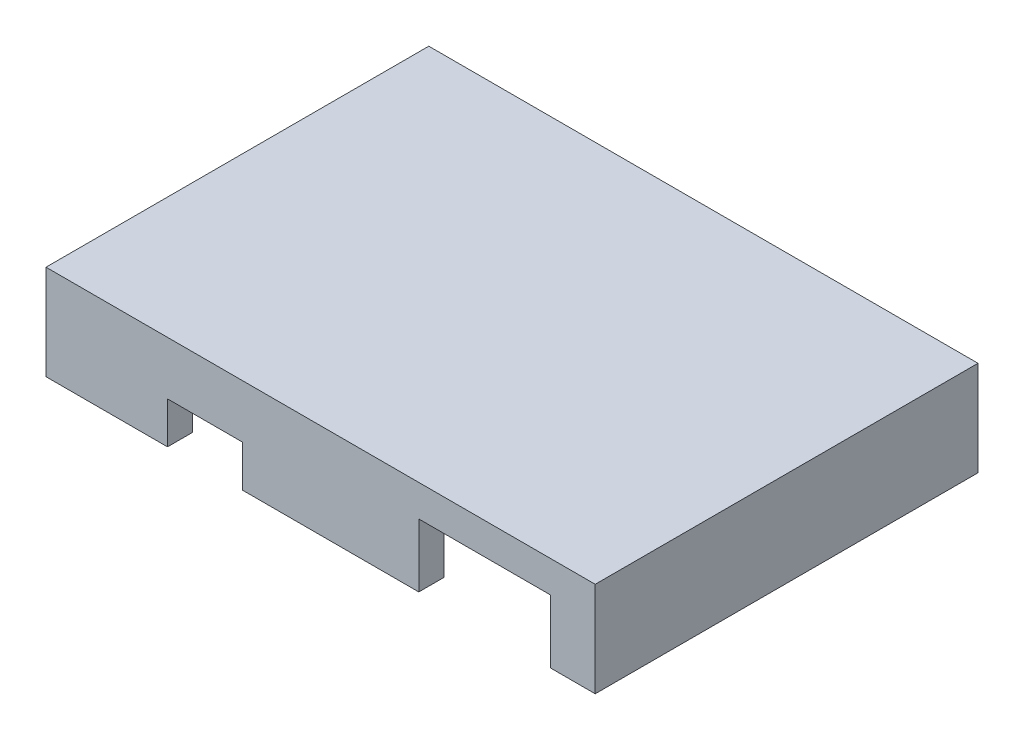
ISO-10303-21;
HEADER;
FILE_DESCRIPTION(('STEP AP214'),'2;1');
FILE_NAME('part.step','',(''),(''),'','','');
FILE_SCHEMA(('AUTOMOTIVE_DESIGN { 1 0 10303 214 1 1 1 1 }'));
ENDSEC;
DATA;
#1=APPLICATION_CONTEXT('core data for automotive mechanical design processes');
#2=APPLICATION_PROTOCOL_DEFINITION('international standard','automotive_design',2000,#1);
#3=PRODUCT_CONTEXT('',#1,'mechanical');
#4=PRODUCT('Part','Part','',(#3));
#5=PRODUCT_RELATED_PRODUCT_CATEGORY('part','',(#4));
#6=PRODUCT_DEFINITION_FORMATION('','',#4);
#7=PRODUCT_DEFINITION_CONTEXT('part definition',#1,'design');
#8=PRODUCT_DEFINITION('design','',#6,#7);
#9=PRODUCT_DEFINITION_SHAPE('','',#8);
#10=(LENGTH_UNIT() NAMED_UNIT(*) SI_UNIT(.MILLI.,.METRE.));
#11=(NAMED_UNIT(*) PLANE_ANGLE_UNIT() SI_UNIT($,.RADIAN.));
#12=(NAMED_UNIT(*) SI_UNIT($,.STERADIAN.) SOLID_ANGLE_UNIT());
#13=UNCERTAINTY_MEASURE_WITH_UNIT(LENGTH_MEASURE(1.E-05),#10,'distance_accuracy_value','');
#14=(GEOMETRIC_REPRESENTATION_CONTEXT(3) GLOBAL_UNCERTAINTY_ASSIGNED_CONTEXT((#13)) GLOBAL_UNIT_ASSIGNED_CONTEXT((#10,
#11,#12)) REPRESENTATION_CONTEXT('',''));
#15=CARTESIAN_POINT('',(0.,0.,0.));
#16=DIRECTION('',(0.,0.,1.));
#17=DIRECTION('',(1.,0.,0.));
#18=AXIS2_PLACEMENT_3D('',#15,#16,#17);
#19=CARTESIAN_POINT('',(0.,4.2,0.));
#20=DIRECTION('',(0.,1.,0.));
#21=DIRECTION('',(0.,0.,1.));
#22=AXIS2_PLACEMENT_3D('',#19,#20,#21);
#23=PLANE('',#22);
#24=DIRECTION('',(1.,0.,0.));
#25=VECTOR('',#24,1.);
#26=CARTESIAN_POINT('',(-15.,4.2,8.8));
#27=LINE('',#26,#25);
#28=CARTESIAN_POINT('',(-15.,4.2,8.8));
#29=VERTEX_POINT('',#28);
#30=CARTESIAN_POINT('',(-13.8,4.2,8.8));
#31=VERTEX_POINT('',#30);
#32=EDGE_CURVE('E293',#29,#31,#27,.T.);
#33=ORIENTED_EDGE('',*,*,#32,.F.);
#34=DIRECTION('',(0.,0.,1.));
#35=VECTOR('',#34,1.);
#36=CARTESIAN_POINT('',(-15.,4.2,-10.));
#37=LINE('',#36,#35);
#38=CARTESIAN_POINT('',(-15.,4.2,-3.3));
#39=VERTEX_POINT('',#38);
#40=EDGE_CURVE('E471',#39,#29,#37,.T.);
#41=ORIENTED_EDGE('',*,*,#40,.F.);
#42=DIRECTION('',(-1.,0.,0.));
#43=VECTOR('',#42,1.);
#44=CARTESIAN_POINT('',(-15.,4.2,-3.30000000000001));
#45=LINE('',#44,#43);
#46=CARTESIAN_POINT('',(-13.8,4.2,-3.30000000000001));
#47=VERTEX_POINT('',#46);
#48=EDGE_CURVE('E298',#47,#39,#45,.T.);
#49=ORIENTED_EDGE('',*,*,#48,.F.);
#50=DIRECTION('',(0.,0.,1.));
#51=VECTOR('',#50,1.);
#52=CARTESIAN_POINT('',(-13.8,4.2,-6.6));
#53=LINE('',#52,#51);
#54=CARTESIAN_POINT('',(-13.8,4.2,-6.6));
#55=VERTEX_POINT('',#54);
#56=EDGE_CURVE('E303',#55,#47,#53,.T.);
#57=ORIENTED_EDGE('',*,*,#56,.F.);
#58=DIRECTION('',(1.,0.,0.));
#59=VECTOR('',#58,1.);
#60=CARTESIAN_POINT('',(-15.,4.2,-6.6));
#61=LINE('',#60,#59);
#62=CARTESIAN_POINT('',(-15.,4.2,-6.6));
#63=VERTEX_POINT('',#62);
#64=EDGE_CURVE('E307',#63,#55,#61,.T.);
#65=ORIENTED_EDGE('',*,*,#64,.F.);
#66=CARTESIAN_POINT('',(-15.,4.2,-10.));
#67=VERTEX_POINT('',#66);
#68=EDGE_CURVE('E472',#67,#63,#37,.T.);
#69=ORIENTED_EDGE('',*,*,#68,.F.);
#70=DIRECTION('',(-1.,0.,0.));
#71=VECTOR('',#70,1.);
#72=CARTESIAN_POINT('',(15.,4.2,-10.));
#73=LINE('',#72,#71);
#74=CARTESIAN_POINT('',(13.,4.2,-10.));
#75=VERTEX_POINT('',#74);
#76=EDGE_CURVE('E469',#75,#67,#73,.T.);
#77=ORIENTED_EDGE('',*,*,#76,.F.);
#78=DIRECTION('',(0.,0.,-1.));
#79=VECTOR('',#78,1.);
#80=CARTESIAN_POINT('',(13.,4.2,-10.));
#81=LINE('',#80,#79);
#82=CARTESIAN_POINT('',(13.,4.2,2.49999999999999));
#83=VERTEX_POINT('',#82);
#84=EDGE_CURVE('E331',#83,#75,#81,.T.);
#85=ORIENTED_EDGE('',*,*,#84,.F.);
#86=DIRECTION('',(-1.,0.,0.));
#87=VECTOR('',#86,1.);
#88=CARTESIAN_POINT('',(15.,4.2,2.49999999999999));
#89=LINE('',#88,#87);
#90=CARTESIAN_POINT('',(15.,4.2,2.49999999999999));
#91=VERTEX_POINT('',#90);
#92=EDGE_CURVE('E336',#91,#83,#89,.T.);
#93=ORIENTED_EDGE('',*,*,#92,.F.);
#94=DIRECTION('',(0.,0.,-1.));
#95=VECTOR('',#94,1.);
#96=CARTESIAN_POINT('',(15.,4.2,9.99999999999999));
#97=LINE('',#96,#95);
#98=CARTESIAN_POINT('',(15.,4.2,9.99999999999999));
#99=VERTEX_POINT('',#98);
#100=EDGE_CURVE('E466',#99,#91,#97,.T.);
#101=ORIENTED_EDGE('',*,*,#100,.F.);
#102=DIRECTION('',(1.,0.,0.));
#103=VECTOR('',#102,1.);
#104=CARTESIAN_POINT('',(-15.,4.2,10.));
#105=LINE('',#104,#103);
#106=CARTESIAN_POINT('',(-13.8,4.2,10.));
#107=VERTEX_POINT('',#106);
#108=EDGE_CURVE('E464',#107,#99,#105,.T.);
#109=ORIENTED_EDGE('',*,*,#108,.F.);
#110=DIRECTION('',(0.,0.,1.));
#111=VECTOR('',#110,1.);
#112=CARTESIAN_POINT('',(-13.8,4.2,10.));
#113=LINE('',#112,#111);
#114=EDGE_CURVE('E54',#31,#107,#113,.T.);
#115=ORIENTED_EDGE('',*,*,#114,.F.);
#116=EDGE_LOOP('',(#33,#41,#49,#57,#65,#69,#77,#85,#93,#101,#109,#115));
#117=FACE_BOUND('',#116,.T.);
#118=ADVANCED_FACE('F39',(#117),#23,.F.);
#119=CARTESIAN_POINT('',(-15.,5.7,10.));
#120=DIRECTION('',(1.,0.,0.));
#121=DIRECTION('',(0.,0.,-1.));
#122=AXIS2_PLACEMENT_3D('',#119,#120,#121);
#123=PLANE('',#122);
#124=ORIENTED_EDGE('',*,*,#40,.T.);
#125=DIRECTION('',(0.,1.,0.));
#126=VECTOR('',#125,1.);
#127=CARTESIAN_POINT('',(-15.,-3.51140997321589,8.8));
#128=LINE('',#127,#126);
#129=CARTESIAN_POINT('',(-15.,1.,8.8));
#130=VERTEX_POINT('',#129);
#131=EDGE_CURVE('E62',#130,#29,#128,.T.);
#132=ORIENTED_EDGE('',*,*,#131,.F.);
#133=DIRECTION('',(0.,0.,-1.));
#134=VECTOR('',#133,1.);
#135=CARTESIAN_POINT('',(-15.,1.,10.));
#136=LINE('',#135,#134);
#137=CARTESIAN_POINT('',(-15.,1.,10.));
#138=VERTEX_POINT('',#137);
#139=EDGE_CURVE('E276',#138,#130,#136,.T.);
#140=ORIENTED_EDGE('',*,*,#139,.F.);
#141=DIRECTION('',(0.,-1.,0.));
#142=VECTOR('',#141,1.);
#143=CARTESIAN_POINT('',(-15.,5.7,10.));
#144=LINE('',#143,#142);
#145=CARTESIAN_POINT('',(-15.,0.,10.));
#146=VERTEX_POINT('',#145);
#147=EDGE_CURVE('E262',#138,#146,#144,.T.);
#148=ORIENTED_EDGE('',*,*,#147,.T.);
#149=DIRECTION('',(0.,0.,1.));
#150=VECTOR('',#149,1.);
#151=CARTESIAN_POINT('',(-15.,0.,10.));
#152=LINE('',#151,#150);
#153=CARTESIAN_POINT('',(-15.,0.,6.85));
#154=VERTEX_POINT('',#153);
#155=EDGE_CURVE('E475',#154,#146,#152,.T.);
#156=ORIENTED_EDGE('',*,*,#155,.F.);
#157=DIRECTION('',(0.,1.,0.));
#158=VECTOR('',#157,1.);
#159=CARTESIAN_POINT('',(-15.,2.5,6.85));
#160=LINE('',#159,#158);
#161=CARTESIAN_POINT('',(-15.,2.5,6.85));
#162=VERTEX_POINT('',#161);
#163=EDGE_CURVE('E366',#154,#162,#160,.T.);
#164=ORIENTED_EDGE('',*,*,#163,.T.);
#165=DIRECTION('',(0.,0.,-1.));
#166=VECTOR('',#165,1.);
#167=CARTESIAN_POINT('',(-15.,2.5,3.49999999999999));
#168=LINE('',#167,#166);
#169=CARTESIAN_POINT('',(-15.,2.5,3.49999999999999));
#170=VERTEX_POINT('',#169);
#171=EDGE_CURVE('E380',#162,#170,#168,.T.);
#172=ORIENTED_EDGE('',*,*,#171,.T.);
#173=DIRECTION('',(0.,-1.,0.));
#174=VECTOR('',#173,1.);
#175=CARTESIAN_POINT('',(-15.,2.5,3.5));
#176=LINE('',#175,#174);
#177=CARTESIAN_POINT('',(-15.,0.,3.5));
#178=VERTEX_POINT('',#177);
#179=EDGE_CURVE('E363',#170,#178,#176,.T.);
#180=ORIENTED_EDGE('',*,*,#179,.T.);
#181=CARTESIAN_POINT('',(-15.,0.,-10.));
#182=VERTEX_POINT('',#181);
#183=EDGE_CURVE('E476',#182,#178,#152,.T.);
#184=ORIENTED_EDGE('',*,*,#183,.F.);
#185=DIRECTION('',(0.,-1.,0.));
#186=VECTOR('',#185,1.);
#187=CARTESIAN_POINT('',(-15.,5.7,-10.));
#188=LINE('',#187,#186);
#189=EDGE_CURVE('E489',#67,#182,#188,.T.);
#190=ORIENTED_EDGE('',*,*,#189,.F.);
#191=ORIENTED_EDGE('',*,*,#68,.T.);
#192=DIRECTION('',(0.,1.,0.));
#193=VECTOR('',#192,1.);
#194=CARTESIAN_POINT('',(-15.,-3.51140997321589,-6.6));
#195=LINE('',#194,#193);
#196=CARTESIAN_POINT('',(-15.,1.,-6.6));
#197=VERTEX_POINT('',#196);
#198=EDGE_CURVE('E310',#197,#63,#195,.T.);
#199=ORIENTED_EDGE('',*,*,#198,.F.);
#200=DIRECTION('',(0.,0.,-1.));
#201=VECTOR('',#200,1.);
#202=CARTESIAN_POINT('',(-15.,1.,-6.6));
#203=LINE('',#202,#201);
#204=CARTESIAN_POINT('',(-15.,1.,-3.3));
#205=VERTEX_POINT('',#204);
#206=EDGE_CURVE('E318',#205,#197,#203,.T.);
#207=ORIENTED_EDGE('',*,*,#206,.F.);
#208=DIRECTION('',(0.,1.,0.));
#209=VECTOR('',#208,1.);
#210=CARTESIAN_POINT('',(-15.,-3.51140997321589,-3.30000000000001));
#211=LINE('',#210,#209);
#212=EDGE_CURVE('E325',#205,#39,#211,.T.);
#213=ORIENTED_EDGE('',*,*,#212,.T.);
#214=EDGE_LOOP('',(#124,#132,#140,#148,#156,#164,#172,#180,#184,#190,#191,#199,#207,#213));
#215=FACE_BOUND('',#214,.T.);
#216=ADVANCED_FACE('F277',(#215),#123,.T.);
#217=CARTESIAN_POINT('',(15.,5.7,9.99999999999999));
#218=DIRECTION('',(0.,0.,-1.));
#219=DIRECTION('',(-1.,0.,0.));
#220=AXIS2_PLACEMENT_3D('',#217,#218,#219);
#221=PLANE('',#220);
#222=DIRECTION('',(-1.,0.,0.));
#223=VECTOR('',#222,1.);
#224=CARTESIAN_POINT('',(-15.,1.,10.));
#225=LINE('',#224,#223);
#226=CARTESIAN_POINT('',(-13.8,1.,10.));
#227=VERTEX_POINT('',#226);
#228=EDGE_CURVE('E265',#227,#138,#225,.T.);
#229=ORIENTED_EDGE('',*,*,#228,.F.);
#230=DIRECTION('',(0.,1.,0.));
#231=VECTOR('',#230,1.);
#232=CARTESIAN_POINT('',(-13.8,-3.51140997321589,10.));
#233=LINE('',#232,#231);
#234=EDGE_CURVE('E285',#227,#107,#233,.T.);
#235=ORIENTED_EDGE('',*,*,#234,.T.);
#236=ORIENTED_EDGE('',*,*,#108,.T.);
#237=DIRECTION('',(0.,-1.,0.));
#238=VECTOR('',#237,1.);
#239=CARTESIAN_POINT('',(15.,5.7,9.99999999999999));
#240=LINE('',#239,#238);
#241=CARTESIAN_POINT('',(15.,0.,9.99999999999999));
#242=VERTEX_POINT('',#241);
#243=EDGE_CURVE('E273',#99,#242,#240,.T.);
#244=ORIENTED_EDGE('',*,*,#243,.T.);
#245=DIRECTION('',(1.,0.,0.));
#246=VECTOR('',#245,1.);
#247=CARTESIAN_POINT('',(15.,0.,9.99999999999999));
#248=LINE('',#247,#246);
#249=CARTESIAN_POINT('',(13.8,0.,10.));
#250=VERTEX_POINT('',#249);
#251=EDGE_CURVE('E479',#250,#242,#248,.T.);
#252=ORIENTED_EDGE('',*,*,#251,.F.);
#253=DIRECTION('',(0.,1.,0.));
#254=VECTOR('',#253,1.);
#255=CARTESIAN_POINT('',(13.8,3.8,9.99999999999999));
#256=LINE('',#255,#254);
#257=CARTESIAN_POINT('',(13.8,3.8,9.99999999999999));
#258=VERTEX_POINT('',#257);
#259=EDGE_CURVE('E409',#250,#258,#256,.T.);
#260=ORIENTED_EDGE('',*,*,#259,.T.);
#261=DIRECTION('',(-1.,0.,0.));
#262=VECTOR('',#261,1.);
#263=CARTESIAN_POINT('',(13.8,3.8,9.99999999999999));
#264=LINE('',#263,#262);
#265=CARTESIAN_POINT('',(5.89999999999999,3.8,10.));
#266=VERTEX_POINT('',#265);
#267=EDGE_CURVE('E392',#258,#266,#264,.T.);
#268=ORIENTED_EDGE('',*,*,#267,.T.);
#269=DIRECTION('',(0.,-1.,0.));
#270=VECTOR('',#269,1.);
#271=CARTESIAN_POINT('',(5.89999999999999,3.8,9.99999999999999));
#272=LINE('',#271,#270);
#273=CARTESIAN_POINT('',(5.89999999999999,0.,10.));
#274=VERTEX_POINT('',#273);
#275=EDGE_CURVE('E395',#266,#274,#272,.T.);
#276=ORIENTED_EDGE('',*,*,#275,.T.);
#277=CARTESIAN_POINT('',(-4.70000000000001,0.,10.));
#278=VERTEX_POINT('',#277);
#279=EDGE_CURVE('E482',#278,#274,#248,.T.);
#280=ORIENTED_EDGE('',*,*,#279,.F.);
#281=DIRECTION('',(0.,1.,0.));
#282=VECTOR('',#281,1.);
#283=CARTESIAN_POINT('',(-4.70000000000001,2.5,10.));
#284=LINE('',#283,#282);
#285=CARTESIAN_POINT('',(-4.70000000000001,2.5,10.));
#286=VERTEX_POINT('',#285);
#287=EDGE_CURVE('E384',#278,#286,#284,.T.);
#288=ORIENTED_EDGE('',*,*,#287,.T.);
#289=DIRECTION('',(-1.,0.,0.));
#290=VECTOR('',#289,1.);
#291=CARTESIAN_POINT('',(-4.70000000000001,2.5,10.));
#292=LINE('',#291,#290);
#293=CARTESIAN_POINT('',(-9.20000000000001,2.5,10.));
#294=VERTEX_POINT('',#293);
#295=EDGE_CURVE('E430',#286,#294,#292,.T.);
#296=ORIENTED_EDGE('',*,*,#295,.T.);
#297=DIRECTION('',(0.,-1.,0.));
#298=VECTOR('',#297,1.);
#299=CARTESIAN_POINT('',(-9.20000000000001,2.5,10.));
#300=LINE('',#299,#298);
#301=CARTESIAN_POINT('',(-9.20000000000001,0.,10.));
#302=VERTEX_POINT('',#301);
#303=EDGE_CURVE('E428',#294,#302,#300,.T.);
#304=ORIENTED_EDGE('',*,*,#303,.T.);
#305=EDGE_CURVE('E269',#146,#302,#248,.T.);
#306=ORIENTED_EDGE('',*,*,#305,.F.);
#307=ORIENTED_EDGE('',*,*,#147,.F.);
#308=EDGE_LOOP('',(#229,#235,#236,#244,#252,#260,#268,#276,#280,#288,#296,#304,#306,#307));
#309=FACE_BOUND('',#308,.T.);
#310=ADVANCED_FACE('F263',(#309),#221,.T.);
#311=CARTESIAN_POINT('',(15.,5.7,9.99999999999999));
#312=DIRECTION('',(-1.,0.,0.));
#313=DIRECTION('',(0.,0.,1.));
#314=AXIS2_PLACEMENT_3D('',#311,#312,#313);
#315=PLANE('',#314);
#316=ORIENTED_EDGE('',*,*,#100,.T.);
#317=DIRECTION('',(0.,1.,0.));
#318=VECTOR('',#317,1.);
#319=CARTESIAN_POINT('',(15.,-12.6589889011722,2.49999999999999));
#320=LINE('',#319,#318);
#321=CARTESIAN_POINT('',(15.,2.,2.49999999999999));
#322=VERTEX_POINT('',#321);
#323=EDGE_CURVE('E314',#322,#91,#320,.T.);
#324=ORIENTED_EDGE('',*,*,#323,.F.);
#325=DIRECTION('',(0.,0.,1.));
#326=VECTOR('',#325,1.);
#327=CARTESIAN_POINT('',(15.,2.,-10.));
#328=LINE('',#327,#326);
#329=CARTESIAN_POINT('',(15.,2.,-10.));
#330=VERTEX_POINT('',#329);
#331=EDGE_CURVE('E346',#330,#322,#328,.T.);
#332=ORIENTED_EDGE('',*,*,#331,.F.);
#333=DIRECTION('',(0.,-1.,0.));
#334=VECTOR('',#333,1.);
#335=CARTESIAN_POINT('',(15.,5.7,-10.));
#336=LINE('',#335,#334);
#337=CARTESIAN_POINT('',(15.,0.,-10.));
#338=VERTEX_POINT('',#337);
#339=EDGE_CURVE('E492',#330,#338,#336,.T.);
#340=ORIENTED_EDGE('',*,*,#339,.T.);
#341=DIRECTION('',(0.,0.,-1.));
#342=VECTOR('',#341,1.);
#343=CARTESIAN_POINT('',(15.,0.,9.99999999999999));
#344=LINE('',#343,#342);
#345=EDGE_CURVE('E481',#242,#338,#344,.T.);
#346=ORIENTED_EDGE('',*,*,#345,.F.);
#347=ORIENTED_EDGE('',*,*,#243,.F.);
#348=EDGE_LOOP('',(#316,#324,#332,#340,#346,#347));
#349=FACE_BOUND('',#348,.T.);
#350=ADVANCED_FACE('F592',(#349),#315,.T.);
#351=CARTESIAN_POINT('',(15.,5.7,-10.));
#352=DIRECTION('',(0.,0.,1.));
#353=DIRECTION('',(1.,0.,0.));
#354=AXIS2_PLACEMENT_3D('',#351,#352,#353);
#355=PLANE('',#354);
#356=DIRECTION('',(1.,0.,0.));
#357=VECTOR('',#356,1.);
#358=CARTESIAN_POINT('',(15.,2.,-10.));
#359=LINE('',#358,#357);
#360=CARTESIAN_POINT('',(13.,2.,-10.));
#361=VERTEX_POINT('',#360);
#362=EDGE_CURVE('E349',#361,#330,#359,.T.);
#363=ORIENTED_EDGE('',*,*,#362,.F.);
#364=DIRECTION('',(0.,1.,0.));
#365=VECTOR('',#364,1.);
#366=CARTESIAN_POINT('',(13.,-12.6589889011722,-10.));
#367=LINE('',#366,#365);
#368=EDGE_CURVE('E334',#361,#75,#367,.T.);
#369=ORIENTED_EDGE('',*,*,#368,.T.);
#370=ORIENTED_EDGE('',*,*,#76,.T.);
#371=ORIENTED_EDGE('',*,*,#189,.T.);
#372=DIRECTION('',(-1.,0.,0.));
#373=VECTOR('',#372,1.);
#374=CARTESIAN_POINT('',(15.,0.,-10.));
#375=LINE('',#374,#373);
#376=CARTESIAN_POINT('',(-13.5,0.,-10.));
#377=VERTEX_POINT('',#376);
#378=EDGE_CURVE('E485',#377,#182,#375,.T.);
#379=ORIENTED_EDGE('',*,*,#378,.F.);
#380=DIRECTION('',(0.,1.,0.));
#381=VECTOR('',#380,1.);
#382=CARTESIAN_POINT('',(-13.5,-1.8,-10.));
#383=LINE('',#382,#381);
#384=CARTESIAN_POINT('',(-13.5,1.8,-10.));
#385=VERTEX_POINT('',#384);
#386=EDGE_CURVE('E460',#377,#385,#383,.T.);
#387=ORIENTED_EDGE('',*,*,#386,.T.);
#388=DIRECTION('',(1.,0.,0.));
#389=VECTOR('',#388,1.);
#390=CARTESIAN_POINT('',(-13.5,1.8,-10.));
#391=LINE('',#390,#389);
#392=CARTESIAN_POINT('',(-6.00000000000002,1.8,-10.));
#393=VERTEX_POINT('',#392);
#394=EDGE_CURVE('E443',#385,#393,#391,.T.);
#395=ORIENTED_EDGE('',*,*,#394,.T.);
#396=DIRECTION('',(0.,-1.,0.));
#397=VECTOR('',#396,1.);
#398=CARTESIAN_POINT('',(-6.00000000000002,-1.8,-10.));
#399=LINE('',#398,#397);
#400=CARTESIAN_POINT('',(-6.00000000000002,0.,-10.));
#401=VERTEX_POINT('',#400);
#402=EDGE_CURVE('E446',#393,#401,#399,.T.);
#403=ORIENTED_EDGE('',*,*,#402,.T.);
#404=EDGE_CURVE('E486',#338,#401,#375,.T.);
#405=ORIENTED_EDGE('',*,*,#404,.F.);
#406=ORIENTED_EDGE('',*,*,#339,.F.);
#407=EDGE_LOOP('',(#363,#369,#370,#371,#379,#387,#395,#403,#405,#406));
#408=FACE_BOUND('',#407,.T.);
#409=ADVANCED_FACE('F543',(#408),#355,.T.);
#410=CARTESIAN_POINT('',(0.,0.,0.));
#411=DIRECTION('',(0.,-1.,0.));
#412=DIRECTION('',(0.,0.,-1.));
#413=AXIS2_PLACEMENT_3D('',#410,#411,#412);
#414=PLANE('',#413);
#415=DIRECTION('',(-1.,0.,0.));
#416=VECTOR('',#415,1.);
#417=CARTESIAN_POINT('',(16.501,0.,3.49999999999999));
#418=LINE('',#417,#416);
#419=CARTESIAN_POINT('',(-16.5,0.,3.5));
#420=VERTEX_POINT('',#419);
#421=EDGE_CURVE('E342',#178,#420,#418,.T.);
#422=ORIENTED_EDGE('',*,*,#421,.T.);
#423=DIRECTION('',(0.,0.,1.));
#424=VECTOR('',#423,1.);
#425=CARTESIAN_POINT('',(-16.5,0.,11.5));
#426=LINE('',#425,#424);
#427=CARTESIAN_POINT('',(-16.5,0.,-11.5));
#428=VERTEX_POINT('',#427);
#429=EDGE_CURVE('E500',#428,#420,#426,.T.);
#430=ORIENTED_EDGE('',*,*,#429,.F.);
#431=DIRECTION('',(-1.,0.,0.));
#432=VECTOR('',#431,1.);
#433=CARTESIAN_POINT('',(16.5,0.,-11.5));
#434=LINE('',#433,#432);
#435=CARTESIAN_POINT('',(-13.5,0.,-11.5));
#436=VERTEX_POINT('',#435);
#437=EDGE_CURVE('E513',#436,#428,#434,.T.);
#438=ORIENTED_EDGE('',*,*,#437,.F.);
#439=DIRECTION('',(0.,0.,1.));
#440=VECTOR('',#439,1.);
#441=CARTESIAN_POINT('',(-13.5,0.,11.501));
#442=LINE('',#441,#440);
#443=EDGE_CURVE('E413',#436,#377,#442,.T.);
#444=ORIENTED_EDGE('',*,*,#443,.T.);
#445=ORIENTED_EDGE('',*,*,#378,.T.);
#446=ORIENTED_EDGE('',*,*,#183,.T.);
#447=EDGE_LOOP('',(#422,#430,#438,#444,#445,#446));
#448=FACE_BOUND('',#447,.T.);
#449=ADVANCED_FACE('F555',(#448),#414,.T.);
#450=DIRECTION('',(0.,0.,-1.));
#451=VECTOR('',#450,1.);
#452=CARTESIAN_POINT('',(13.8,0.,-11.501));
#453=LINE('',#452,#451);
#454=CARTESIAN_POINT('',(13.8,0.,11.5));
#455=VERTEX_POINT('',#454);
#456=EDGE_CURVE('E385',#455,#250,#453,.T.);
#457=ORIENTED_EDGE('',*,*,#456,.T.);
#458=ORIENTED_EDGE('',*,*,#251,.T.);
#459=ORIENTED_EDGE('',*,*,#345,.T.);
#460=ORIENTED_EDGE('',*,*,#404,.T.);
#461=DIRECTION('',(0.,0.,-1.));
#462=VECTOR('',#461,1.);
#463=CARTESIAN_POINT('',(-6.00000000000002,0.,11.501));
#464=LINE('',#463,#462);
#465=CARTESIAN_POINT('',(-6.00000000000002,0.,-11.5));
#466=VERTEX_POINT('',#465);
#467=EDGE_CURVE('E440',#401,#466,#464,.T.);
#468=ORIENTED_EDGE('',*,*,#467,.T.);
#469=CARTESIAN_POINT('',(16.5,0.,-11.5));
#470=VERTEX_POINT('',#469);
#471=EDGE_CURVE('E514',#470,#466,#434,.T.);
#472=ORIENTED_EDGE('',*,*,#471,.F.);
#473=DIRECTION('',(0.,0.,-1.));
#474=VECTOR('',#473,1.);
#475=CARTESIAN_POINT('',(16.5,0.,11.5));
#476=LINE('',#475,#474);
#477=CARTESIAN_POINT('',(16.5,0.,11.5));
#478=VERTEX_POINT('',#477);
#479=EDGE_CURVE('E510',#478,#470,#476,.T.);
#480=ORIENTED_EDGE('',*,*,#479,.F.);
#481=DIRECTION('',(1.,0.,0.));
#482=VECTOR('',#481,1.);
#483=CARTESIAN_POINT('',(16.5,0.,11.5));
#484=LINE('',#483,#482);
#485=EDGE_CURVE('E272',#455,#478,#484,.T.);
#486=ORIENTED_EDGE('',*,*,#485,.F.);
#487=EDGE_LOOP('',(#457,#458,#459,#460,#468,#472,#480,#486));
#488=FACE_BOUND('',#487,.T.);
#489=ADVANCED_FACE('F536',(#488),#414,.T.);
#490=DIRECTION('',(0.,0.,1.));
#491=VECTOR('',#490,1.);
#492=CARTESIAN_POINT('',(5.89999999999999,0.,-11.501));
#493=LINE('',#492,#491);
#494=CARTESIAN_POINT('',(5.89999999999999,0.,11.5));
#495=VERTEX_POINT('',#494);
#496=EDGE_CURVE('E388',#274,#495,#493,.T.);
#497=ORIENTED_EDGE('',*,*,#496,.T.);
#498=CARTESIAN_POINT('',(-4.70000000000001,0.,11.5));
#499=VERTEX_POINT('',#498);
#500=EDGE_CURVE('E511',#499,#495,#484,.T.);
#501=ORIENTED_EDGE('',*,*,#500,.F.);
#502=DIRECTION('',(0.,0.,-1.));
#503=VECTOR('',#502,1.);
#504=CARTESIAN_POINT('',(-4.70000000000001,0.,-11.501));
#505=LINE('',#504,#503);
#506=EDGE_CURVE('E389',#499,#278,#505,.T.);
#507=ORIENTED_EDGE('',*,*,#506,.T.);
#508=ORIENTED_EDGE('',*,*,#279,.T.);
#509=EDGE_LOOP('',(#497,#501,#507,#508));
#510=FACE_BOUND('',#509,.T.);
#511=ADVANCED_FACE('F576',(#510),#414,.T.);
#512=CARTESIAN_POINT('',(0.,5.7,0.));
#513=DIRECTION('',(0.,-1.,0.));
#514=DIRECTION('',(0.,0.,-1.));
#515=AXIS2_PLACEMENT_3D('',#512,#513,#514);
#516=PLANE('',#515);
#517=DIRECTION('',(1.,0.,0.));
#518=VECTOR('',#517,1.);
#519=CARTESIAN_POINT('',(16.5,5.7,11.5));
#520=LINE('',#519,#518);
#521=CARTESIAN_POINT('',(-16.5,5.7,11.5));
#522=VERTEX_POINT('',#521);
#523=CARTESIAN_POINT('',(16.5,5.7,11.5));
#524=VERTEX_POINT('',#523);
#525=EDGE_CURVE('E496',#522,#524,#520,.T.);
#526=ORIENTED_EDGE('',*,*,#525,.T.);
#527=DIRECTION('',(0.,0.,-1.));
#528=VECTOR('',#527,1.);
#529=CARTESIAN_POINT('',(16.5,5.7,11.5));
#530=LINE('',#529,#528);
#531=CARTESIAN_POINT('',(16.5,5.7,-11.5));
#532=VERTEX_POINT('',#531);
#533=EDGE_CURVE('E499',#524,#532,#530,.T.);
#534=ORIENTED_EDGE('',*,*,#533,.T.);
#535=DIRECTION('',(-1.,0.,0.));
#536=VECTOR('',#535,1.);
#537=CARTESIAN_POINT('',(16.5,5.7,-11.5));
#538=LINE('',#537,#536);
#539=CARTESIAN_POINT('',(-16.5,5.7,-11.5));
#540=VERTEX_POINT('',#539);
#541=EDGE_CURVE('E502',#532,#540,#538,.T.);
#542=ORIENTED_EDGE('',*,*,#541,.T.);
#543=DIRECTION('',(0.,0.,1.));
#544=VECTOR('',#543,1.);
#545=CARTESIAN_POINT('',(-16.5,5.7,11.5));
#546=LINE('',#545,#544);
#547=EDGE_CURVE('E504',#540,#522,#546,.T.);
#548=ORIENTED_EDGE('',*,*,#547,.T.);
#549=EDGE_LOOP('',(#526,#534,#542,#548));
#550=FACE_BOUND('',#549,.T.);
#551=ADVANCED_FACE('F564',(#550),#516,.F.);
#552=DIRECTION('',(1.,0.,0.));
#553=VECTOR('',#552,1.);
#554=CARTESIAN_POINT('',(16.501,0.,6.84999999999999));
#555=LINE('',#554,#553);
#556=CARTESIAN_POINT('',(-16.5,0.,6.85));
#557=VERTEX_POINT('',#556);
#558=EDGE_CURVE('E360',#557,#154,#555,.T.);
#559=ORIENTED_EDGE('',*,*,#558,.T.);
#560=ORIENTED_EDGE('',*,*,#155,.T.);
#561=ORIENTED_EDGE('',*,*,#305,.T.);
#562=DIRECTION('',(0.,0.,1.));
#563=VECTOR('',#562,1.);
#564=CARTESIAN_POINT('',(-9.20000000000001,0.,-11.501));
#565=LINE('',#564,#563);
#566=CARTESIAN_POINT('',(-9.20000000000001,0.,11.5));
#567=VERTEX_POINT('',#566);
#568=EDGE_CURVE('E433',#302,#567,#565,.T.);
#569=ORIENTED_EDGE('',*,*,#568,.T.);
#570=CARTESIAN_POINT('',(-16.5,0.,11.5));
#571=VERTEX_POINT('',#570);
#572=EDGE_CURVE('E507',#571,#567,#484,.T.);
#573=ORIENTED_EDGE('',*,*,#572,.F.);
#574=EDGE_CURVE('E517',#557,#571,#426,.T.);
#575=ORIENTED_EDGE('',*,*,#574,.F.);
#576=EDGE_LOOP('',(#559,#560,#561,#569,#573,#575));
#577=FACE_BOUND('',#576,.T.);
#578=ADVANCED_FACE('F616',(#577),#414,.T.);
#579=CARTESIAN_POINT('',(16.5,5.7,11.5));
#580=DIRECTION('',(0.,0.,-1.));
#581=DIRECTION('',(-1.,0.,0.));
#582=AXIS2_PLACEMENT_3D('',#579,#580,#581);
#583=PLANE('',#582);
#584=DIRECTION('',(-1.,0.,0.));
#585=VECTOR('',#584,1.);
#586=CARTESIAN_POINT('',(13.8,3.8,11.5));
#587=LINE('',#586,#585);
#588=CARTESIAN_POINT('',(13.8,3.8,11.5));
#589=VERTEX_POINT('',#588);
#590=CARTESIAN_POINT('',(5.89999999999999,3.8,11.5));
#591=VERTEX_POINT('',#590);
#592=EDGE_CURVE('E403',#589,#591,#587,.T.);
#593=ORIENTED_EDGE('',*,*,#592,.F.);
#594=DIRECTION('',(0.,1.,0.));
#595=VECTOR('',#594,1.);
#596=CARTESIAN_POINT('',(13.8,3.8,11.5));
#597=LINE('',#596,#595);
#598=EDGE_CURVE('E400',#455,#589,#597,.T.);
#599=ORIENTED_EDGE('',*,*,#598,.F.);
#600=ORIENTED_EDGE('',*,*,#485,.T.);
#601=DIRECTION('',(0.,-1.,0.));
#602=VECTOR('',#601,1.);
#603=CARTESIAN_POINT('',(16.5,5.7,11.5));
#604=LINE('',#603,#602);
#605=EDGE_CURVE('E12',#524,#478,#604,.T.);
#606=ORIENTED_EDGE('',*,*,#605,.F.);
#607=ORIENTED_EDGE('',*,*,#525,.F.);
#608=DIRECTION('',(0.,-1.,0.));
#609=VECTOR('',#608,1.);
#610=CARTESIAN_POINT('',(-16.5,5.7,11.5));
#611=LINE('',#610,#609);
#612=EDGE_CURVE('E506',#522,#571,#611,.T.);
#613=ORIENTED_EDGE('',*,*,#612,.T.);
#614=ORIENTED_EDGE('',*,*,#572,.T.);
#615=DIRECTION('',(0.,-1.,0.));
#616=VECTOR('',#615,1.);
#617=CARTESIAN_POINT('',(-9.20000000000001,2.5,11.5));
#618=LINE('',#617,#616);
#619=CARTESIAN_POINT('',(-9.20000000000001,2.5,11.5));
#620=VERTEX_POINT('',#619);
#621=EDGE_CURVE('E426',#620,#567,#618,.T.);
#622=ORIENTED_EDGE('',*,*,#621,.F.);
#623=DIRECTION('',(-1.,0.,0.));
#624=VECTOR('',#623,1.);
#625=CARTESIAN_POINT('',(-4.70000000000001,2.5,11.5));
#626=LINE('',#625,#624);
#627=CARTESIAN_POINT('',(-4.70000000000001,2.5,11.5));
#628=VERTEX_POINT('',#627);
#629=EDGE_CURVE('E419',#628,#620,#626,.T.);
#630=ORIENTED_EDGE('',*,*,#629,.F.);
#631=DIRECTION('',(0.,1.,0.));
#632=VECTOR('',#631,1.);
#633=CARTESIAN_POINT('',(-4.70000000000001,2.5,11.5));
#634=LINE('',#633,#632);
#635=EDGE_CURVE('E423',#499,#628,#634,.T.);
#636=ORIENTED_EDGE('',*,*,#635,.F.);
#637=ORIENTED_EDGE('',*,*,#500,.T.);
#638=DIRECTION('',(0.,-1.,0.));
#639=VECTOR('',#638,1.);
#640=CARTESIAN_POINT('',(5.89999999999999,3.8,11.5));
#641=LINE('',#640,#639);
#642=EDGE_CURVE('E398',#591,#495,#641,.T.);
#643=ORIENTED_EDGE('',*,*,#642,.F.);
#644=EDGE_LOOP('',(#593,#599,#600,#606,#607,#613,#614,#622,#630,#636,#637,#643));
#645=FACE_BOUND('',#644,.T.);
#646=ADVANCED_FACE('F41',(#645),#583,.F.);
#647=CARTESIAN_POINT('',(16.5,5.7,11.5));
#648=DIRECTION('',(-1.,0.,0.));
#649=DIRECTION('',(0.,0.,1.));
#650=AXIS2_PLACEMENT_3D('',#647,#648,#649);
#651=PLANE('',#650);
#652=ORIENTED_EDGE('',*,*,#479,.T.);
#653=DIRECTION('',(0.,-1.,0.));
#654=VECTOR('',#653,1.);
#655=CARTESIAN_POINT('',(16.5,5.7,-11.5));
#656=LINE('',#655,#654);
#657=EDGE_CURVE('E47',#532,#470,#656,.T.);
#658=ORIENTED_EDGE('',*,*,#657,.F.);
#659=ORIENTED_EDGE('',*,*,#533,.F.);
#660=ORIENTED_EDGE('',*,*,#605,.T.);
#661=EDGE_LOOP('',(#652,#658,#659,#660));
#662=FACE_BOUND('',#661,.T.);
#663=ADVANCED_FACE('F566',(#662),#651,.F.);
#664=CARTESIAN_POINT('',(16.5,5.7,-11.5));
#665=DIRECTION('',(0.,0.,1.));
#666=DIRECTION('',(1.,0.,0.));
#667=AXIS2_PLACEMENT_3D('',#664,#665,#666);
#668=PLANE('',#667);
#669=DIRECTION('',(1.,0.,0.));
#670=VECTOR('',#669,1.);
#671=CARTESIAN_POINT('',(-13.5,1.8,-11.5));
#672=LINE('',#671,#670);
#673=CARTESIAN_POINT('',(-13.5,1.8,-11.5));
#674=VERTEX_POINT('',#673);
#675=CARTESIAN_POINT('',(-6.00000000000002,1.8,-11.5));
#676=VERTEX_POINT('',#675);
#677=EDGE_CURVE('E454',#674,#676,#672,.T.);
#678=ORIENTED_EDGE('',*,*,#677,.F.);
#679=DIRECTION('',(0.,1.,0.));
#680=VECTOR('',#679,1.);
#681=CARTESIAN_POINT('',(-13.5,-1.8,-11.5));
#682=LINE('',#681,#680);
#683=EDGE_CURVE('E451',#436,#674,#682,.T.);
#684=ORIENTED_EDGE('',*,*,#683,.F.);
#685=ORIENTED_EDGE('',*,*,#437,.T.);
#686=DIRECTION('',(0.,-1.,0.));
#687=VECTOR('',#686,1.);
#688=CARTESIAN_POINT('',(-16.5,5.7,-11.5));
#689=LINE('',#688,#687);
#690=EDGE_CURVE('E522',#540,#428,#689,.T.);
#691=ORIENTED_EDGE('',*,*,#690,.F.);
#692=ORIENTED_EDGE('',*,*,#541,.F.);
#693=ORIENTED_EDGE('',*,*,#657,.T.);
#694=ORIENTED_EDGE('',*,*,#471,.T.);
#695=DIRECTION('',(0.,-1.,0.));
#696=VECTOR('',#695,1.);
#697=CARTESIAN_POINT('',(-6.00000000000002,-1.8,-11.5));
#698=LINE('',#697,#696);
#699=EDGE_CURVE('E449',#676,#466,#698,.T.);
#700=ORIENTED_EDGE('',*,*,#699,.F.);
#701=EDGE_LOOP('',(#678,#684,#685,#691,#692,#693,#694,#700));
#702=FACE_BOUND('',#701,.T.);
#703=ADVANCED_FACE('F530',(#702),#668,.F.);
#704=CARTESIAN_POINT('',(-16.5,5.7,11.5));
#705=DIRECTION('',(1.,0.,0.));
#706=DIRECTION('',(0.,0.,-1.));
#707=AXIS2_PLACEMENT_3D('',#704,#705,#706);
#708=PLANE('',#707);
#709=ORIENTED_EDGE('',*,*,#429,.T.);
#710=DIRECTION('',(0.,-1.,0.));
#711=VECTOR('',#710,1.);
#712=CARTESIAN_POINT('',(-16.5,2.5,3.5));
#713=LINE('',#712,#711);
#714=CARTESIAN_POINT('',(-16.5,2.5,3.5));
#715=VERTEX_POINT('',#714);
#716=EDGE_CURVE('E375',#715,#420,#713,.T.);
#717=ORIENTED_EDGE('',*,*,#716,.F.);
#718=DIRECTION('',(0.,0.,-1.));
#719=VECTOR('',#718,1.);
#720=CARTESIAN_POINT('',(-16.5,2.5,3.5));
#721=LINE('',#720,#719);
#722=CARTESIAN_POINT('',(-16.5,2.5,6.85));
#723=VERTEX_POINT('',#722);
#724=EDGE_CURVE('E372',#723,#715,#721,.T.);
#725=ORIENTED_EDGE('',*,*,#724,.F.);
#726=DIRECTION('',(0.,1.,0.));
#727=VECTOR('',#726,1.);
#728=CARTESIAN_POINT('',(-16.5,2.5,6.85));
#729=LINE('',#728,#727);
#730=EDGE_CURVE('E369',#557,#723,#729,.T.);
#731=ORIENTED_EDGE('',*,*,#730,.F.);
#732=ORIENTED_EDGE('',*,*,#574,.T.);
#733=ORIENTED_EDGE('',*,*,#612,.F.);
#734=ORIENTED_EDGE('',*,*,#547,.F.);
#735=ORIENTED_EDGE('',*,*,#690,.T.);
#736=EDGE_LOOP('',(#709,#717,#725,#731,#732,#733,#734,#735));
#737=FACE_BOUND('',#736,.T.);
#738=ADVANCED_FACE('F558',(#737),#708,.F.);
#739=CARTESIAN_POINT('',(-13.5,-1.8,11.501));
#740=DIRECTION('',(-1.,0.,0.));
#741=DIRECTION('',(0.,0.,1.));
#742=AXIS2_PLACEMENT_3D('',#739,#740,#741);
#743=PLANE('',#742);
#744=ORIENTED_EDGE('',*,*,#443,.F.);
#745=ORIENTED_EDGE('',*,*,#683,.T.);
#746=DIRECTION('',(0.,0.,-1.));
#747=VECTOR('',#746,1.);
#748=CARTESIAN_POINT('',(-13.5,1.8,11.501));
#749=LINE('',#748,#747);
#750=EDGE_CURVE('E456',#385,#674,#749,.T.);
#751=ORIENTED_EDGE('',*,*,#750,.F.);
#752=ORIENTED_EDGE('',*,*,#386,.F.);
#753=EDGE_LOOP('',(#744,#745,#751,#752));
#754=FACE_BOUND('',#753,.T.);
#755=ADVANCED_FACE('F550',(#754),#743,.F.);
#756=CARTESIAN_POINT('',(-13.5,1.8,11.501));
#757=DIRECTION('',(0.,1.,0.));
#758=DIRECTION('',(0.,0.,1.));
#759=AXIS2_PLACEMENT_3D('',#756,#757,#758);
#760=PLANE('',#759);
#761=ORIENTED_EDGE('',*,*,#750,.T.);
#762=ORIENTED_EDGE('',*,*,#677,.T.);
#763=DIRECTION('',(0.,0.,-1.));
#764=VECTOR('',#763,1.);
#765=CARTESIAN_POINT('',(-6.00000000000002,1.8,11.501));
#766=LINE('',#765,#764);
#767=EDGE_CURVE('E457',#393,#676,#766,.T.);
#768=ORIENTED_EDGE('',*,*,#767,.F.);
#769=ORIENTED_EDGE('',*,*,#394,.F.);
#770=EDGE_LOOP('',(#761,#762,#768,#769));
#771=FACE_BOUND('',#770,.T.);
#772=ADVANCED_FACE('F548',(#771),#760,.F.);
#773=CARTESIAN_POINT('',(-6.00000000000002,-1.8,11.501));
#774=DIRECTION('',(1.,0.,0.));
#775=DIRECTION('',(0.,0.,-1.));
#776=AXIS2_PLACEMENT_3D('',#773,#774,#775);
#777=PLANE('',#776);
#778=ORIENTED_EDGE('',*,*,#767,.T.);
#779=ORIENTED_EDGE('',*,*,#699,.T.);
#780=ORIENTED_EDGE('',*,*,#467,.F.);
#781=ORIENTED_EDGE('',*,*,#402,.F.);
#782=EDGE_LOOP('',(#778,#779,#780,#781));
#783=FACE_BOUND('',#782,.T.);
#784=ADVANCED_FACE('F540',(#783),#777,.F.);
#785=CARTESIAN_POINT('',(-4.70000000000001,2.5,-11.501));
#786=DIRECTION('',(1.,0.,0.));
#787=DIRECTION('',(0.,0.,-1.));
#788=AXIS2_PLACEMENT_3D('',#785,#786,#787);
#789=PLANE('',#788);
#790=ORIENTED_EDGE('',*,*,#506,.F.);
#791=ORIENTED_EDGE('',*,*,#635,.T.);
#792=DIRECTION('',(0.,0.,1.));
#793=VECTOR('',#792,1.);
#794=CARTESIAN_POINT('',(-4.70000000000001,2.5,-11.501));
#795=LINE('',#794,#793);
#796=EDGE_CURVE('E417',#286,#628,#795,.T.);
#797=ORIENTED_EDGE('',*,*,#796,.F.);
#798=ORIENTED_EDGE('',*,*,#287,.F.);
#799=EDGE_LOOP('',(#790,#791,#797,#798));
#800=FACE_BOUND('',#799,.T.);
#801=ADVANCED_FACE('F625',(#800),#789,.F.);
#802=CARTESIAN_POINT('',(-4.70000000000001,2.5,-11.501));
#803=DIRECTION('',(0.,1.,0.));
#804=DIRECTION('',(0.,0.,1.));
#805=AXIS2_PLACEMENT_3D('',#802,#803,#804);
#806=PLANE('',#805);
#807=ORIENTED_EDGE('',*,*,#796,.T.);
#808=ORIENTED_EDGE('',*,*,#629,.T.);
#809=DIRECTION('',(0.,0.,1.));
#810=VECTOR('',#809,1.);
#811=CARTESIAN_POINT('',(-9.20000000000001,2.5,-11.501));
#812=LINE('',#811,#810);
#813=EDGE_CURVE('E416',#294,#620,#812,.T.);
#814=ORIENTED_EDGE('',*,*,#813,.F.);
#815=ORIENTED_EDGE('',*,*,#295,.F.);
#816=EDGE_LOOP('',(#807,#808,#814,#815));
#817=FACE_BOUND('',#816,.T.);
#818=ADVANCED_FACE('F623',(#817),#806,.F.);
#819=CARTESIAN_POINT('',(-9.20000000000001,2.5,-11.501));
#820=DIRECTION('',(-1.,0.,0.));
#821=DIRECTION('',(0.,0.,1.));
#822=AXIS2_PLACEMENT_3D('',#819,#820,#821);
#823=PLANE('',#822);
#824=ORIENTED_EDGE('',*,*,#813,.T.);
#825=ORIENTED_EDGE('',*,*,#621,.T.);
#826=ORIENTED_EDGE('',*,*,#568,.F.);
#827=ORIENTED_EDGE('',*,*,#303,.F.);
#828=EDGE_LOOP('',(#824,#825,#826,#827));
#829=FACE_BOUND('',#828,.T.);
#830=ADVANCED_FACE('F619',(#829),#823,.F.);
#831=CARTESIAN_POINT('',(13.8,3.8,-11.501));
#832=DIRECTION('',(1.,0.,0.));
#833=DIRECTION('',(0.,1.,0.));
#834=AXIS2_PLACEMENT_3D('',#831,#832,#833);
#835=PLANE('',#834);
#836=ORIENTED_EDGE('',*,*,#456,.F.);
#837=ORIENTED_EDGE('',*,*,#598,.T.);
#838=DIRECTION('',(0.,0.,1.));
#839=VECTOR('',#838,1.);
#840=CARTESIAN_POINT('',(13.8,3.8,-11.501));
#841=LINE('',#840,#839);
#842=EDGE_CURVE('E405',#258,#589,#841,.T.);
#843=ORIENTED_EDGE('',*,*,#842,.F.);
#844=ORIENTED_EDGE('',*,*,#259,.F.);
#845=EDGE_LOOP('',(#836,#837,#843,#844));
#846=FACE_BOUND('',#845,.T.);
#847=ADVANCED_FACE('F587',(#846),#835,.F.);
#848=CARTESIAN_POINT('',(13.8,3.8,-11.501));
#849=DIRECTION('',(0.,1.,0.));
#850=DIRECTION('',(-1.,0.,0.));
#851=AXIS2_PLACEMENT_3D('',#848,#849,#850);
#852=PLANE('',#851);
#853=ORIENTED_EDGE('',*,*,#842,.T.);
#854=ORIENTED_EDGE('',*,*,#592,.T.);
#855=DIRECTION('',(0.,0.,1.));
#856=VECTOR('',#855,1.);
#857=CARTESIAN_POINT('',(5.89999999999999,3.8,-11.501));
#858=LINE('',#857,#856);
#859=EDGE_CURVE('E406',#266,#591,#858,.T.);
#860=ORIENTED_EDGE('',*,*,#859,.F.);
#861=ORIENTED_EDGE('',*,*,#267,.F.);
#862=EDGE_LOOP('',(#853,#854,#860,#861));
#863=FACE_BOUND('',#862,.T.);
#864=ADVANCED_FACE('F585',(#863),#852,.F.);
#865=CARTESIAN_POINT('',(5.89999999999999,3.8,-11.501));
#866=DIRECTION('',(-1.,0.,0.));
#867=DIRECTION('',(0.,0.,1.));
#868=AXIS2_PLACEMENT_3D('',#865,#866,#867);
#869=PLANE('',#868);
#870=ORIENTED_EDGE('',*,*,#859,.T.);
#871=ORIENTED_EDGE('',*,*,#642,.T.);
#872=ORIENTED_EDGE('',*,*,#496,.F.);
#873=ORIENTED_EDGE('',*,*,#275,.F.);
#874=EDGE_LOOP('',(#870,#871,#872,#873));
#875=FACE_BOUND('',#874,.T.);
#876=ADVANCED_FACE('F581',(#875),#869,.F.);
#877=CARTESIAN_POINT('',(16.501,2.5,3.49999999999999));
#878=DIRECTION('',(0.,1.,0.));
#879=DIRECTION('',(0.,0.,1.));
#880=AXIS2_PLACEMENT_3D('',#877,#878,#879);
#881=PLANE('',#880);
#882=DIRECTION('',(-1.,0.,0.));
#883=VECTOR('',#882,1.);
#884=CARTESIAN_POINT('',(16.501,2.5,6.84999999999999));
#885=LINE('',#884,#883);
#886=EDGE_CURVE('E377',#162,#723,#885,.T.);
#887=ORIENTED_EDGE('',*,*,#886,.T.);
#888=ORIENTED_EDGE('',*,*,#724,.T.);
#889=DIRECTION('',(-1.,0.,0.));
#890=VECTOR('',#889,1.);
#891=CARTESIAN_POINT('',(16.501,2.5,3.49999999999999));
#892=LINE('',#891,#890);
#893=EDGE_CURVE('E378',#170,#715,#892,.T.);
#894=ORIENTED_EDGE('',*,*,#893,.F.);
#895=ORIENTED_EDGE('',*,*,#171,.F.);
#896=EDGE_LOOP('',(#887,#888,#894,#895));
#897=FACE_BOUND('',#896,.T.);
#898=ADVANCED_FACE('F609',(#897),#881,.F.);
#899=CARTESIAN_POINT('',(16.501,2.5,3.49999999999999));
#900=DIRECTION('',(0.,0.,-1.));
#901=DIRECTION('',(-1.,0.,0.));
#902=AXIS2_PLACEMENT_3D('',#899,#900,#901);
#903=PLANE('',#902);
#904=ORIENTED_EDGE('',*,*,#893,.T.);
#905=ORIENTED_EDGE('',*,*,#716,.T.);
#906=ORIENTED_EDGE('',*,*,#421,.F.);
#907=ORIENTED_EDGE('',*,*,#179,.F.);
#908=EDGE_LOOP('',(#904,#905,#906,#907));
#909=FACE_BOUND('',#908,.T.);
#910=ADVANCED_FACE('F607',(#909),#903,.F.);
#911=CARTESIAN_POINT('',(16.501,2.5,6.84999999999999));
#912=DIRECTION('',(0.,0.,1.));
#913=DIRECTION('',(0.,-1.,0.));
#914=AXIS2_PLACEMENT_3D('',#911,#912,#913);
#915=PLANE('',#914);
#916=ORIENTED_EDGE('',*,*,#558,.F.);
#917=ORIENTED_EDGE('',*,*,#730,.T.);
#918=ORIENTED_EDGE('',*,*,#886,.F.);
#919=ORIENTED_EDGE('',*,*,#163,.F.);
#920=EDGE_LOOP('',(#916,#917,#918,#919));
#921=FACE_BOUND('',#920,.T.);
#922=ADVANCED_FACE('F626',(#921),#915,.F.);
#923=CARTESIAN_POINT('',(15.,-12.6589889011722,2.49999999999999));
#924=DIRECTION('',(0.,0.,-1.));
#925=DIRECTION('',(-1.,0.,0.));
#926=AXIS2_PLACEMENT_3D('',#923,#924,#925);
#927=PLANE('',#926);
#928=DIRECTION('',(-1.,0.,0.));
#929=VECTOR('',#928,1.);
#930=CARTESIAN_POINT('',(15.,2.,2.49999999999999));
#931=LINE('',#930,#929);
#932=CARTESIAN_POINT('',(13.,2.,2.49999999999999));
#933=VERTEX_POINT('',#932);
#934=EDGE_CURVE('E343',#322,#933,#931,.T.);
#935=ORIENTED_EDGE('',*,*,#934,.F.);
#936=ORIENTED_EDGE('',*,*,#323,.T.);
#937=ORIENTED_EDGE('',*,*,#92,.T.);
#938=DIRECTION('',(0.,1.,0.));
#939=VECTOR('',#938,1.);
#940=CARTESIAN_POINT('',(13.,-12.6589889011722,2.49999999999999));
#941=LINE('',#940,#939);
#942=EDGE_CURVE('E335',#933,#83,#941,.T.);
#943=ORIENTED_EDGE('',*,*,#942,.F.);
#944=EDGE_LOOP('',(#935,#936,#937,#943));
#945=FACE_BOUND('',#944,.T.);
#946=ADVANCED_FACE('F601',(#945),#927,.F.);
#947=CARTESIAN_POINT('',(13.,-12.6589889011722,-10.));
#948=DIRECTION('',(1.,0.,0.));
#949=DIRECTION('',(0.,0.,-1.));
#950=AXIS2_PLACEMENT_3D('',#947,#948,#949);
#951=PLANE('',#950);
#952=DIRECTION('',(0.,0.,-1.));
#953=VECTOR('',#952,1.);
#954=CARTESIAN_POINT('',(13.,2.,-10.));
#955=LINE('',#954,#953);
#956=EDGE_CURVE('E339',#933,#361,#955,.T.);
#957=ORIENTED_EDGE('',*,*,#956,.F.);
#958=ORIENTED_EDGE('',*,*,#942,.T.);
#959=ORIENTED_EDGE('',*,*,#84,.T.);
#960=ORIENTED_EDGE('',*,*,#368,.F.);
#961=EDGE_LOOP('',(#957,#958,#959,#960));
#962=FACE_BOUND('',#961,.T.);
#963=ADVANCED_FACE('F599',(#962),#951,.F.);
#964=CARTESIAN_POINT('',(0.,2.,0.));
#965=DIRECTION('',(0.,-1.,0.));
#966=DIRECTION('',(0.,0.,-1.));
#967=AXIS2_PLACEMENT_3D('',#964,#965,#966);
#968=PLANE('',#967);
#969=ORIENTED_EDGE('',*,*,#362,.T.);
#970=ORIENTED_EDGE('',*,*,#331,.T.);
#971=ORIENTED_EDGE('',*,*,#934,.T.);
#972=ORIENTED_EDGE('',*,*,#956,.T.);
#973=EDGE_LOOP('',(#969,#970,#971,#972));
#974=FACE_BOUND('',#973,.T.);
#975=ADVANCED_FACE('F595',(#974),#968,.T.);
#976=CARTESIAN_POINT('',(-15.,-3.51140997321589,-6.6));
#977=DIRECTION('',(0.,0.,1.));
#978=DIRECTION('',(1.,0.,0.));
#979=AXIS2_PLACEMENT_3D('',#976,#977,#978);
#980=PLANE('',#979);
#981=DIRECTION('',(1.,0.,0.));
#982=VECTOR('',#981,1.);
#983=CARTESIAN_POINT('',(-15.,1.,-6.6));
#984=LINE('',#983,#982);
#985=CARTESIAN_POINT('',(-13.8,1.,-6.6));
#986=VERTEX_POINT('',#985);
#987=EDGE_CURVE('E315',#197,#986,#984,.T.);
#988=ORIENTED_EDGE('',*,*,#987,.F.);
#989=ORIENTED_EDGE('',*,*,#198,.T.);
#990=ORIENTED_EDGE('',*,*,#64,.T.);
#991=DIRECTION('',(0.,1.,0.));
#992=VECTOR('',#991,1.);
#993=CARTESIAN_POINT('',(-13.8,-3.51140997321589,-6.6));
#994=LINE('',#993,#992);
#995=EDGE_CURVE('E306',#986,#55,#994,.T.);
#996=ORIENTED_EDGE('',*,*,#995,.F.);
#997=EDGE_LOOP('',(#988,#989,#990,#996));
#998=FACE_BOUND('',#997,.T.);
#999=ADVANCED_FACE('F726',(#998),#980,.F.);
#1000=CARTESIAN_POINT('',(-13.8,-3.51140997321589,-6.6));
#1001=DIRECTION('',(-1.,0.,0.));
#1002=DIRECTION('',(0.,0.,1.));
#1003=AXIS2_PLACEMENT_3D('',#1000,#1001,#1002);
#1004=PLANE('',#1003);
#1005=DIRECTION('',(0.,0.,1.));
#1006=VECTOR('',#1005,1.);
#1007=CARTESIAN_POINT('',(-13.8,1.,-6.6));
#1008=LINE('',#1007,#1006);
#1009=CARTESIAN_POINT('',(-13.8,1.,-3.30000000000001));
#1010=VERTEX_POINT('',#1009);
#1011=EDGE_CURVE('E311',#986,#1010,#1008,.T.);
#1012=ORIENTED_EDGE('',*,*,#1011,.F.);
#1013=ORIENTED_EDGE('',*,*,#995,.T.);
#1014=ORIENTED_EDGE('',*,*,#56,.T.);
#1015=DIRECTION('',(0.,1.,0.));
#1016=VECTOR('',#1015,1.);
#1017=CARTESIAN_POINT('',(-13.8,-3.51140997321589,-3.30000000000001));
#1018=LINE('',#1017,#1016);
#1019=EDGE_CURVE('E302',#1010,#47,#1018,.T.);
#1020=ORIENTED_EDGE('',*,*,#1019,.F.);
#1021=EDGE_LOOP('',(#1012,#1013,#1014,#1020));
#1022=FACE_BOUND('',#1021,.T.);
#1023=ADVANCED_FACE('F918',(#1022),#1004,.F.);
#1024=CARTESIAN_POINT('',(-15.,-3.51140997321589,-3.30000000000001));
#1025=DIRECTION('',(0.,0.,-1.));
#1026=DIRECTION('',(-1.,0.,0.));
#1027=AXIS2_PLACEMENT_3D('',#1024,#1025,#1026);
#1028=PLANE('',#1027);
#1029=DIRECTION('',(-1.,0.,0.));
#1030=VECTOR('',#1029,1.);
#1031=CARTESIAN_POINT('',(-15.,1.,-3.30000000000001));
#1032=LINE('',#1031,#1030);
#1033=EDGE_CURVE('E301',#1010,#205,#1032,.T.);
#1034=ORIENTED_EDGE('',*,*,#1033,.F.);
#1035=ORIENTED_EDGE('',*,*,#1019,.T.);
#1036=ORIENTED_EDGE('',*,*,#48,.T.);
#1037=ORIENTED_EDGE('',*,*,#212,.F.);
#1038=EDGE_LOOP('',(#1034,#1035,#1036,#1037));
#1039=FACE_BOUND('',#1038,.T.);
#1040=ADVANCED_FACE('F915',(#1039),#1028,.F.);
#1041=CARTESIAN_POINT('',(0.,1.,0.));
#1042=DIRECTION('',(0.,-1.,0.));
#1043=DIRECTION('',(0.,0.,-1.));
#1044=AXIS2_PLACEMENT_3D('',#1041,#1042,#1043);
#1045=PLANE('',#1044);
#1046=ORIENTED_EDGE('',*,*,#1033,.T.);
#1047=ORIENTED_EDGE('',*,*,#206,.T.);
#1048=ORIENTED_EDGE('',*,*,#987,.T.);
#1049=ORIENTED_EDGE('',*,*,#1011,.T.);
#1050=EDGE_LOOP('',(#1046,#1047,#1048,#1049));
#1051=FACE_BOUND('',#1050,.T.);
#1052=ADVANCED_FACE('F911',(#1051),#1045,.T.);
#1053=CARTESIAN_POINT('',(-15.,-3.51140997321589,8.8));
#1054=DIRECTION('',(0.,0.,1.));
#1055=DIRECTION('',(1.,0.,0.));
#1056=AXIS2_PLACEMENT_3D('',#1053,#1054,#1055);
#1057=PLANE('',#1056);
#1058=DIRECTION('',(1.,0.,0.));
#1059=VECTOR('',#1058,1.);
#1060=CARTESIAN_POINT('',(-15.,1.,8.8));
#1061=LINE('',#1060,#1059);
#1062=CARTESIAN_POINT('',(-13.8,1.,8.8));
#1063=VERTEX_POINT('',#1062);
#1064=EDGE_CURVE('E280',#130,#1063,#1061,.T.);
#1065=ORIENTED_EDGE('',*,*,#1064,.F.);
#1066=ORIENTED_EDGE('',*,*,#131,.T.);
#1067=ORIENTED_EDGE('',*,*,#32,.T.);
#1068=DIRECTION('',(0.,1.,0.));
#1069=VECTOR('',#1068,1.);
#1070=CARTESIAN_POINT('',(-13.8,-3.51140997321589,8.8));
#1071=LINE('',#1070,#1069);
#1072=EDGE_CURVE('E296',#1063,#31,#1071,.T.);
#1073=ORIENTED_EDGE('',*,*,#1072,.F.);
#1074=EDGE_LOOP('',(#1065,#1066,#1067,#1073));
#1075=FACE_BOUND('',#1074,.T.);
#1076=ADVANCED_FACE('F914',(#1075),#1057,.F.);
#1077=CARTESIAN_POINT('',(-13.8,-3.51140997321589,10.));
#1078=DIRECTION('',(-1.,0.,0.));
#1079=DIRECTION('',(0.,0.,1.));
#1080=AXIS2_PLACEMENT_3D('',#1077,#1078,#1079);
#1081=PLANE('',#1080);
#1082=DIRECTION('',(0.,0.,1.));
#1083=VECTOR('',#1082,1.);
#1084=CARTESIAN_POINT('',(-13.8,1.,10.));
#1085=LINE('',#1084,#1083);
#1086=EDGE_CURVE('E284',#1063,#227,#1085,.T.);
#1087=ORIENTED_EDGE('',*,*,#1086,.F.);
#1088=ORIENTED_EDGE('',*,*,#1072,.T.);
#1089=ORIENTED_EDGE('',*,*,#114,.T.);
#1090=ORIENTED_EDGE('',*,*,#234,.F.);
#1091=EDGE_LOOP('',(#1087,#1088,#1089,#1090));
#1092=FACE_BOUND('',#1091,.T.);
#1093=ADVANCED_FACE('F926',(#1092),#1081,.F.);
#1094=CARTESIAN_POINT('',(0.,1.,0.));
#1095=DIRECTION('',(0.,-1.,0.));
#1096=DIRECTION('',(0.,0.,-1.));
#1097=AXIS2_PLACEMENT_3D('',#1094,#1095,#1096);
#1098=PLANE('',#1097);
#1099=ORIENTED_EDGE('',*,*,#228,.T.);
#1100=ORIENTED_EDGE('',*,*,#139,.T.);
#1101=ORIENTED_EDGE('',*,*,#1064,.T.);
#1102=ORIENTED_EDGE('',*,*,#1086,.T.);
#1103=EDGE_LOOP('',(#1099,#1100,#1101,#1102));
#1104=FACE_BOUND('',#1103,.T.);
#1105=ADVANCED_FACE('F283',(#1104),#1098,.T.);
#1106=CLOSED_SHELL('',(#118,#216,#310,#350,#409,#449,#489,#511,#551,#578,#646,#663,#703,#738,
#755,#772,#784,#801,#818,#830,#847,#864,#876,#898,#910,#922,#946,#963,#975,#999,#1023,#1040,
#1052,#1076,#1093,#1105));
#1107=MANIFOLD_SOLID_BREP('B2',#1106);
#1108=ADVANCED_BREP_SHAPE_REPRESENTATION('',(#18,#1107),#14);
#1109=SHAPE_DEFINITION_REPRESENTATION(#9,#1108);
ENDSEC;
END-ISO-10303-21;
